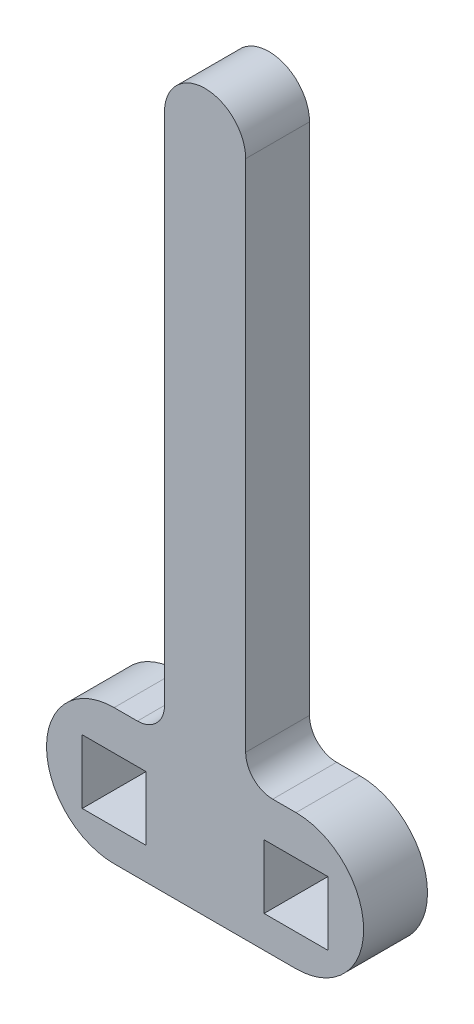
ISO-10303-21;
HEADER;
FILE_DESCRIPTION(('STEP AP214'),'2;1');
FILE_NAME('part.step','',(''),(''),'','','');
FILE_SCHEMA(('AUTOMOTIVE_DESIGN { 1 0 10303 214 1 1 1 1 }'));
ENDSEC;
DATA;
#1=APPLICATION_CONTEXT('core data for automotive mechanical design processes');
#2=APPLICATION_PROTOCOL_DEFINITION('international standard','automotive_design',2000,#1);
#3=PRODUCT_CONTEXT('',#1,'mechanical');
#4=PRODUCT('Part','Part','',(#3));
#5=PRODUCT_RELATED_PRODUCT_CATEGORY('part','',(#4));
#6=PRODUCT_DEFINITION_FORMATION('','',#4);
#7=PRODUCT_DEFINITION_CONTEXT('part definition',#1,'design');
#8=PRODUCT_DEFINITION('design','',#6,#7);
#9=PRODUCT_DEFINITION_SHAPE('','',#8);
#10=(LENGTH_UNIT() NAMED_UNIT(*) SI_UNIT(.MILLI.,.METRE.));
#11=(NAMED_UNIT(*) PLANE_ANGLE_UNIT() SI_UNIT($,.RADIAN.));
#12=(NAMED_UNIT(*) SI_UNIT($,.STERADIAN.) SOLID_ANGLE_UNIT());
#13=UNCERTAINTY_MEASURE_WITH_UNIT(LENGTH_MEASURE(1.E-05),#10,'distance_accuracy_value','');
#14=(GEOMETRIC_REPRESENTATION_CONTEXT(3) GLOBAL_UNCERTAINTY_ASSIGNED_CONTEXT((#13)) GLOBAL_UNIT_ASSIGNED_CONTEXT((#10,
#11,#12)) REPRESENTATION_CONTEXT('',''));
#15=CARTESIAN_POINT('',(0.,0.,0.));
#16=DIRECTION('',(0.,0.,1.));
#17=DIRECTION('',(1.,0.,0.));
#18=AXIS2_PLACEMENT_3D('',#15,#16,#17);
#19=CARTESIAN_POINT('',(384.610540850945,118.343994152131,5.9944));
#20=DIRECTION('',(0.,0.,1.));
#21=DIRECTION('',(1.,0.,0.));
#22=AXIS2_PLACEMENT_3D('',#19,#20,#21);
#23=PLANE('',#22);
#24=CARTESIAN_POINT('',(384.610540850945,118.343994152131,5.9944));
#25=DIRECTION('',(0.,0.,1.));
#26=DIRECTION('',(1.,0.,0.));
#27=AXIS2_PLACEMENT_3D('',#24,#25,#26);
#28=CIRCLE('',#27,6.34999999999999);
#29=CARTESIAN_POINT('',(384.610540850945,111.993994152131,5.9944));
#30=VERTEX_POINT('',#29);
#31=CARTESIAN_POINT('',(384.610540850945,124.693994152131,5.9944));
#32=VERTEX_POINT('',#31);
#33=EDGE_CURVE('E249',#30,#32,#28,.T.);
#34=ORIENTED_EDGE('',*,*,#33,.T.);
#35=DIRECTION('',(-1.,0.,0.));
#36=VECTOR('',#35,1.);
#37=CARTESIAN_POINT('',(384.610540850945,124.693994152131,5.9944));
#38=LINE('',#37,#36);
#39=CARTESIAN_POINT('',(382.424153120892,124.693994152131,5.9944));
#40=VERTEX_POINT('',#39);
#41=EDGE_CURVE('E254',#32,#40,#38,.T.);
#42=ORIENTED_EDGE('',*,*,#41,.T.);
#43=CARTESIAN_POINT('',(382.424153120892,127.233994152131,5.9944));
#44=DIRECTION('',(0.,0.,-1.));
#45=DIRECTION('',(1.,0.,0.));
#46=AXIS2_PLACEMENT_3D('',#43,#44,#45);
#47=CIRCLE('',#46,2.53999999999999);
#48=CARTESIAN_POINT('',(379.884153120892,127.233994152131,5.9944));
#49=VERTEX_POINT('',#48);
#50=EDGE_CURVE('E264',#40,#49,#47,.T.);
#51=ORIENTED_EDGE('',*,*,#50,.T.);
#52=DIRECTION('',(0.,1.,0.));
#53=VECTOR('',#52,1.);
#54=CARTESIAN_POINT('',(379.884153120892,127.233994152131,5.9944));
#55=LINE('',#54,#53);
#56=CARTESIAN_POINT('',(379.884153120892,175.493994152131,5.9944));
#57=VERTEX_POINT('',#56);
#58=EDGE_CURVE('E267',#49,#57,#55,.T.);
#59=ORIENTED_EDGE('',*,*,#58,.T.);
#60=CARTESIAN_POINT('',(376.074153120892,175.493994152131,5.9944));
#61=DIRECTION('',(0.,0.,1.));
#62=DIRECTION('',(1.,0.,0.));
#63=AXIS2_PLACEMENT_3D('',#60,#61,#62);
#64=CIRCLE('',#63,3.80999999999998);
#65=CARTESIAN_POINT('',(372.264153120892,175.493994152131,5.9944));
#66=VERTEX_POINT('',#65);
#67=EDGE_CURVE('E271',#57,#66,#64,.T.);
#68=ORIENTED_EDGE('',*,*,#67,.T.);
#69=DIRECTION('',(0.,-1.,0.));
#70=VECTOR('',#69,1.);
#71=CARTESIAN_POINT('',(372.264153120892,127.233994152131,5.9944));
#72=LINE('',#71,#70);
#73=CARTESIAN_POINT('',(372.264153120892,127.233994152131,5.9944));
#74=VERTEX_POINT('',#73);
#75=EDGE_CURVE('E275',#66,#74,#72,.T.);
#76=ORIENTED_EDGE('',*,*,#75,.T.);
#77=CARTESIAN_POINT('',(369.724153120892,127.233994152131,5.9944));
#78=DIRECTION('',(0.,0.,-1.));
#79=DIRECTION('',(-1.,0.,0.));
#80=AXIS2_PLACEMENT_3D('',#77,#78,#79);
#81=CIRCLE('',#80,2.53999999999999);
#82=CARTESIAN_POINT('',(369.724153120892,124.693994152131,5.9944));
#83=VERTEX_POINT('',#82);
#84=EDGE_CURVE('E283',#74,#83,#81,.T.);
#85=ORIENTED_EDGE('',*,*,#84,.T.);
#86=DIRECTION('',(-1.,0.,0.));
#87=VECTOR('',#86,1.);
#88=CARTESIAN_POINT('',(369.724153120892,124.693994152131,5.9944));
#89=LINE('',#88,#87);
#90=CARTESIAN_POINT('',(367.53776539084,124.693994152131,5.9944));
#91=VERTEX_POINT('',#90);
#92=EDGE_CURVE('E286',#83,#91,#89,.T.);
#93=ORIENTED_EDGE('',*,*,#92,.T.);
#94=CARTESIAN_POINT('',(367.53776539084,118.343994152131,5.9944));
#95=DIRECTION('',(0.,0.,1.));
#96=DIRECTION('',(1.,0.,0.));
#97=AXIS2_PLACEMENT_3D('',#94,#95,#96);
#98=CIRCLE('',#97,6.35000000000011);
#99=CARTESIAN_POINT('',(367.53776539084,111.993994152131,5.9944));
#100=VERTEX_POINT('',#99);
#101=EDGE_CURVE('E290',#91,#100,#98,.T.);
#102=ORIENTED_EDGE('',*,*,#101,.T.);
#103=DIRECTION('',(1.,0.,0.));
#104=VECTOR('',#103,1.);
#105=CARTESIAN_POINT('',(384.610540850945,111.993994152131,5.9944));
#106=LINE('',#105,#104);
#107=EDGE_CURVE('E294',#100,#30,#106,.T.);
#108=ORIENTED_EDGE('',*,*,#107,.T.);
#109=EDGE_LOOP('',(#34,#42,#51,#59,#68,#76,#85,#93,#102,#108));
#110=FACE_BOUND('',#109,.T.);
#111=DIRECTION('',(-1.,0.,0.));
#112=VECTOR('',#111,1.);
#113=CARTESIAN_POINT('',(387.607740850945,120.988448440542,5.9944));
#114=LINE('',#113,#112);
#115=CARTESIAN_POINT('',(387.607740850945,120.988448440542,5.9944));
#116=VERTEX_POINT('',#115);
#117=CARTESIAN_POINT('',(381.613340850945,120.988448440542,5.9944));
#118=VERTEX_POINT('',#117);
#119=EDGE_CURVE('E215',#116,#118,#114,.T.);
#120=ORIENTED_EDGE('',*,*,#119,.F.);
#121=DIRECTION('',(0.,1.,0.));
#122=VECTOR('',#121,1.);
#123=CARTESIAN_POINT('',(387.607740850945,114.994048440542,5.9944));
#124=LINE('',#123,#122);
#125=CARTESIAN_POINT('',(387.607740850945,114.994048440542,5.9944));
#126=VERTEX_POINT('',#125);
#127=EDGE_CURVE('E211',#126,#116,#124,.T.);
#128=ORIENTED_EDGE('',*,*,#127,.F.);
#129=DIRECTION('',(1.,0.,0.));
#130=VECTOR('',#129,1.);
#131=CARTESIAN_POINT('',(387.607740850945,114.994048440542,5.9944));
#132=LINE('',#131,#130);
#133=CARTESIAN_POINT('',(381.613340850945,114.994048440542,5.9944));
#134=VERTEX_POINT('',#133);
#135=EDGE_CURVE('E222',#134,#126,#132,.T.);
#136=ORIENTED_EDGE('',*,*,#135,.F.);
#137=DIRECTION('',(0.,-1.,0.));
#138=VECTOR('',#137,1.);
#139=CARTESIAN_POINT('',(381.613340850945,114.994048440542,5.9944));
#140=LINE('',#139,#138);
#141=EDGE_CURVE('E227',#118,#134,#140,.T.);
#142=ORIENTED_EDGE('',*,*,#141,.F.);
#143=EDGE_LOOP('',(#120,#128,#136,#142));
#144=FACE_BOUND('',#143,.T.);
#145=DIRECTION('',(1.,0.,0.));
#146=VECTOR('',#145,1.);
#147=CARTESIAN_POINT('',(364.540565390845,114.994048440543,5.9944));
#148=LINE('',#147,#146);
#149=CARTESIAN_POINT('',(364.540565390845,114.994048440543,5.9944));
#150=VERTEX_POINT('',#149);
#151=CARTESIAN_POINT('',(370.534965390845,114.994048440543,5.9944));
#152=VERTEX_POINT('',#151);
#153=EDGE_CURVE('E171',#150,#152,#148,.T.);
#154=ORIENTED_EDGE('',*,*,#153,.F.);
#155=DIRECTION('',(0.,-1.,0.));
#156=VECTOR('',#155,1.);
#157=CARTESIAN_POINT('',(364.540565390845,120.988448440543,5.9944));
#158=LINE('',#157,#156);
#159=CARTESIAN_POINT('',(364.540565390845,120.988448440543,5.9944));
#160=VERTEX_POINT('',#159);
#161=EDGE_CURVE('E162',#160,#150,#158,.T.);
#162=ORIENTED_EDGE('',*,*,#161,.F.);
#163=DIRECTION('',(-1.,0.,0.));
#164=VECTOR('',#163,1.);
#165=CARTESIAN_POINT('',(364.540565390845,120.988448440543,5.9944));
#166=LINE('',#165,#164);
#167=CARTESIAN_POINT('',(370.534965390845,120.988448440543,5.9944));
#168=VERTEX_POINT('',#167);
#169=EDGE_CURVE('E188',#168,#160,#166,.T.);
#170=ORIENTED_EDGE('',*,*,#169,.F.);
#171=DIRECTION('',(0.,1.,0.));
#172=VECTOR('',#171,1.);
#173=CARTESIAN_POINT('',(370.534965390845,120.988448440543,5.9944));
#174=LINE('',#173,#172);
#175=EDGE_CURVE('E183',#152,#168,#174,.T.);
#176=ORIENTED_EDGE('',*,*,#175,.F.);
#177=EDGE_LOOP('',(#154,#162,#170,#176));
#178=FACE_BOUND('',#177,.T.);
#179=ADVANCED_FACE('F37',(#110,#144,#178),#23,.T.);
#180=CARTESIAN_POINT('',(384.610540850945,118.343994152131,0.));
#181=DIRECTION('',(0.,0.,1.));
#182=DIRECTION('',(1.,0.,0.));
#183=AXIS2_PLACEMENT_3D('',#180,#181,#182);
#184=PLANE('',#183);
#185=DIRECTION('',(0.,1.,0.));
#186=VECTOR('',#185,1.);
#187=CARTESIAN_POINT('',(387.607740850945,114.994048440542,0.));
#188=LINE('',#187,#186);
#189=CARTESIAN_POINT('',(387.607740850945,114.994048440542,0.));
#190=VERTEX_POINT('',#189);
#191=CARTESIAN_POINT('',(387.607740850945,120.988448440542,0.));
#192=VERTEX_POINT('',#191);
#193=EDGE_CURVE('E179',#190,#192,#188,.T.);
#194=ORIENTED_EDGE('',*,*,#193,.T.);
#195=DIRECTION('',(-1.,0.,0.));
#196=VECTOR('',#195,1.);
#197=CARTESIAN_POINT('',(387.607740850945,120.988448440542,0.));
#198=LINE('',#197,#196);
#199=CARTESIAN_POINT('',(381.613340850945,120.988448440542,0.));
#200=VERTEX_POINT('',#199);
#201=EDGE_CURVE('E231',#192,#200,#198,.T.);
#202=ORIENTED_EDGE('',*,*,#201,.T.);
#203=DIRECTION('',(0.,-1.,0.));
#204=VECTOR('',#203,1.);
#205=CARTESIAN_POINT('',(381.613340850945,114.994048440542,0.));
#206=LINE('',#205,#204);
#207=CARTESIAN_POINT('',(381.613340850945,114.994048440542,0.));
#208=VERTEX_POINT('',#207);
#209=EDGE_CURVE('E234',#200,#208,#206,.T.);
#210=ORIENTED_EDGE('',*,*,#209,.T.);
#211=DIRECTION('',(1.,0.,0.));
#212=VECTOR('',#211,1.);
#213=CARTESIAN_POINT('',(387.607740850945,114.994048440542,0.));
#214=LINE('',#213,#212);
#215=EDGE_CURVE('E216',#208,#190,#214,.T.);
#216=ORIENTED_EDGE('',*,*,#215,.T.);
#217=EDGE_LOOP('',(#194,#202,#210,#216));
#218=FACE_BOUND('',#217,.T.);
#219=CARTESIAN_POINT('',(384.610540850945,118.343994152131,0.));
#220=DIRECTION('',(0.,0.,1.));
#221=DIRECTION('',(1.,0.,0.));
#222=AXIS2_PLACEMENT_3D('',#219,#220,#221);
#223=CIRCLE('',#222,6.34999999999999);
#224=CARTESIAN_POINT('',(384.610540850945,111.993994152131,0.));
#225=VERTEX_POINT('',#224);
#226=CARTESIAN_POINT('',(384.610540850945,124.693994152131,0.));
#227=VERTEX_POINT('',#226);
#228=EDGE_CURVE('E248',#225,#227,#223,.T.);
#229=ORIENTED_EDGE('',*,*,#228,.F.);
#230=DIRECTION('',(1.,0.,0.));
#231=VECTOR('',#230,1.);
#232=CARTESIAN_POINT('',(384.610540850945,111.993994152131,0.));
#233=LINE('',#232,#231);
#234=CARTESIAN_POINT('',(367.53776539084,111.993994152131,0.));
#235=VERTEX_POINT('',#234);
#236=EDGE_CURVE('E255',#235,#225,#233,.T.);
#237=ORIENTED_EDGE('',*,*,#236,.F.);
#238=CARTESIAN_POINT('',(367.53776539084,118.343994152131,0.));
#239=DIRECTION('',(0.,0.,1.));
#240=DIRECTION('',(1.,0.,0.));
#241=AXIS2_PLACEMENT_3D('',#238,#239,#240);
#242=CIRCLE('',#241,6.35000000000011);
#243=CARTESIAN_POINT('',(367.53776539084,124.693994152131,0.));
#244=VERTEX_POINT('',#243);
#245=EDGE_CURVE('E315',#244,#235,#242,.T.);
#246=ORIENTED_EDGE('',*,*,#245,.F.);
#247=DIRECTION('',(-1.,0.,0.));
#248=VECTOR('',#247,1.);
#249=CARTESIAN_POINT('',(369.724153120892,124.693994152131,0.));
#250=LINE('',#249,#248);
#251=CARTESIAN_POINT('',(369.724153120892,124.693994152131,0.));
#252=VERTEX_POINT('',#251);
#253=EDGE_CURVE('E313',#252,#244,#250,.T.);
#254=ORIENTED_EDGE('',*,*,#253,.F.);
#255=CARTESIAN_POINT('',(369.724153120892,127.233994152131,0.));
#256=DIRECTION('',(0.,0.,-1.));
#257=DIRECTION('',(-1.,0.,0.));
#258=AXIS2_PLACEMENT_3D('',#255,#256,#257);
#259=CIRCLE('',#258,2.53999999999999);
#260=CARTESIAN_POINT('',(372.264153120892,127.233994152131,0.));
#261=VERTEX_POINT('',#260);
#262=EDGE_CURVE('E311',#261,#252,#259,.T.);
#263=ORIENTED_EDGE('',*,*,#262,.F.);
#264=DIRECTION('',(0.,-1.,0.));
#265=VECTOR('',#264,1.);
#266=CARTESIAN_POINT('',(372.264153120892,127.233994152131,0.));
#267=LINE('',#266,#265);
#268=CARTESIAN_POINT('',(372.264153120892,175.493994152131,0.));
#269=VERTEX_POINT('',#268);
#270=EDGE_CURVE('E309',#269,#261,#267,.T.);
#271=ORIENTED_EDGE('',*,*,#270,.F.);
#272=CARTESIAN_POINT('',(376.074153120892,175.493994152131,0.));
#273=DIRECTION('',(0.,0.,1.));
#274=DIRECTION('',(1.,0.,0.));
#275=AXIS2_PLACEMENT_3D('',#272,#273,#274);
#276=CIRCLE('',#275,3.80999999999998);
#277=CARTESIAN_POINT('',(379.884153120892,175.493994152131,0.));
#278=VERTEX_POINT('',#277);
#279=EDGE_CURVE('E307',#278,#269,#276,.T.);
#280=ORIENTED_EDGE('',*,*,#279,.F.);
#281=DIRECTION('',(0.,1.,0.));
#282=VECTOR('',#281,1.);
#283=CARTESIAN_POINT('',(379.884153120892,127.233994152131,0.));
#284=LINE('',#283,#282);
#285=CARTESIAN_POINT('',(379.884153120892,127.233994152131,0.));
#286=VERTEX_POINT('',#285);
#287=EDGE_CURVE('E305',#286,#278,#284,.T.);
#288=ORIENTED_EDGE('',*,*,#287,.F.);
#289=CARTESIAN_POINT('',(382.424153120892,127.233994152131,0.));
#290=DIRECTION('',(0.,0.,-1.));
#291=DIRECTION('',(1.,0.,0.));
#292=AXIS2_PLACEMENT_3D('',#289,#290,#291);
#293=CIRCLE('',#292,2.53999999999999);
#294=CARTESIAN_POINT('',(382.424153120892,124.693994152131,0.));
#295=VERTEX_POINT('',#294);
#296=EDGE_CURVE('E303',#295,#286,#293,.T.);
#297=ORIENTED_EDGE('',*,*,#296,.F.);
#298=DIRECTION('',(-1.,0.,0.));
#299=VECTOR('',#298,1.);
#300=CARTESIAN_POINT('',(384.610540850945,124.693994152131,0.));
#301=LINE('',#300,#299);
#302=EDGE_CURVE('E301',#227,#295,#301,.T.);
#303=ORIENTED_EDGE('',*,*,#302,.F.);
#304=EDGE_LOOP('',(#229,#237,#246,#254,#263,#271,#280,#288,#297,#303));
#305=FACE_BOUND('',#304,.T.);
#306=DIRECTION('',(0.,-1.,0.));
#307=VECTOR('',#306,1.);
#308=CARTESIAN_POINT('',(364.540565390845,120.988448440543,0.));
#309=LINE('',#308,#307);
#310=CARTESIAN_POINT('',(364.540565390845,120.988448440543,0.));
#311=VERTEX_POINT('',#310);
#312=CARTESIAN_POINT('',(364.540565390845,114.994048440543,0.));
#313=VERTEX_POINT('',#312);
#314=EDGE_CURVE('E60',#311,#313,#309,.T.);
#315=ORIENTED_EDGE('',*,*,#314,.T.);
#316=DIRECTION('',(1.,0.,0.));
#317=VECTOR('',#316,1.);
#318=CARTESIAN_POINT('',(364.540565390845,114.994048440543,0.));
#319=LINE('',#318,#317);
#320=CARTESIAN_POINT('',(370.534965390845,114.994048440543,0.));
#321=VERTEX_POINT('',#320);
#322=EDGE_CURVE('E178',#313,#321,#319,.T.);
#323=ORIENTED_EDGE('',*,*,#322,.T.);
#324=DIRECTION('',(0.,1.,0.));
#325=VECTOR('',#324,1.);
#326=CARTESIAN_POINT('',(370.534965390845,120.988448440543,0.));
#327=LINE('',#326,#325);
#328=CARTESIAN_POINT('',(370.534965390845,120.988448440543,0.));
#329=VERTEX_POINT('',#328);
#330=EDGE_CURVE('E203',#321,#329,#327,.T.);
#331=ORIENTED_EDGE('',*,*,#330,.T.);
#332=DIRECTION('',(-1.,0.,0.));
#333=VECTOR('',#332,1.);
#334=CARTESIAN_POINT('',(364.540565390845,120.988448440543,0.));
#335=LINE('',#334,#333);
#336=EDGE_CURVE('E172',#329,#311,#335,.T.);
#337=ORIENTED_EDGE('',*,*,#336,.T.);
#338=EDGE_LOOP('',(#315,#323,#331,#337));
#339=FACE_BOUND('',#338,.T.);
#340=ADVANCED_FACE('F351',(#218,#305,#339),#184,.F.);
#341=CARTESIAN_POINT('',(384.610540850945,118.343994152131,5.9944));
#342=DIRECTION('',(0.,0.,-1.));
#343=DIRECTION('',(-1.,0.,0.));
#344=AXIS2_PLACEMENT_3D('',#341,#342,#343);
#345=CYLINDRICAL_SURFACE('',#344,6.34999999999999);
#346=ORIENTED_EDGE('',*,*,#228,.T.);
#347=DIRECTION('',(0.,0.,-1.));
#348=VECTOR('',#347,1.);
#349=CARTESIAN_POINT('',(384.610540850945,124.693994152131,5.9944));
#350=LINE('',#349,#348);
#351=EDGE_CURVE('E12',#32,#227,#350,.T.);
#352=ORIENTED_EDGE('',*,*,#351,.F.);
#353=ORIENTED_EDGE('',*,*,#33,.F.);
#354=DIRECTION('',(0.,0.,-1.));
#355=VECTOR('',#354,1.);
#356=CARTESIAN_POINT('',(384.610540850945,111.993994152131,5.9944));
#357=LINE('',#356,#355);
#358=EDGE_CURVE('E298',#30,#225,#357,.T.);
#359=ORIENTED_EDGE('',*,*,#358,.T.);
#360=EDGE_LOOP('',(#346,#352,#353,#359));
#361=FACE_BOUND('',#360,.T.);
#362=ADVANCED_FACE('F39',(#361),#345,.T.);
#363=CARTESIAN_POINT('',(384.610540850945,124.693994152131,5.9944));
#364=DIRECTION('',(0.,-1.,0.));
#365=DIRECTION('',(0.,0.,-1.));
#366=AXIS2_PLACEMENT_3D('',#363,#364,#365);
#367=PLANE('',#366);
#368=ORIENTED_EDGE('',*,*,#302,.T.);
#369=DIRECTION('',(0.,0.,-1.));
#370=VECTOR('',#369,1.);
#371=CARTESIAN_POINT('',(382.424153120892,124.693994152131,5.9944));
#372=LINE('',#371,#370);
#373=EDGE_CURVE('E45',#40,#295,#372,.T.);
#374=ORIENTED_EDGE('',*,*,#373,.F.);
#375=ORIENTED_EDGE('',*,*,#41,.F.);
#376=ORIENTED_EDGE('',*,*,#351,.T.);
#377=EDGE_LOOP('',(#368,#374,#375,#376));
#378=FACE_BOUND('',#377,.T.);
#379=ADVANCED_FACE('F431',(#378),#367,.F.);
#380=CARTESIAN_POINT('',(382.424153120892,127.233994152131,5.9944));
#381=DIRECTION('',(0.,0.,-1.));
#382=DIRECTION('',(-1.,0.,0.));
#383=AXIS2_PLACEMENT_3D('',#380,#381,#382);
#384=CYLINDRICAL_SURFACE('',#383,2.53999999999999);
#385=ORIENTED_EDGE('',*,*,#296,.T.);
#386=DIRECTION('',(0.,0.,-1.));
#387=VECTOR('',#386,1.);
#388=CARTESIAN_POINT('',(379.884153120892,127.233994152131,5.9944));
#389=LINE('',#388,#387);
#390=EDGE_CURVE('E338',#49,#286,#389,.T.);
#391=ORIENTED_EDGE('',*,*,#390,.F.);
#392=ORIENTED_EDGE('',*,*,#50,.F.);
#393=ORIENTED_EDGE('',*,*,#373,.T.);
#394=EDGE_LOOP('',(#385,#391,#392,#393));
#395=FACE_BOUND('',#394,.T.);
#396=ADVANCED_FACE('F345',(#395),#384,.F.);
#397=CARTESIAN_POINT('',(379.884153120892,127.233994152131,5.9944));
#398=DIRECTION('',(-1.,0.,0.));
#399=DIRECTION('',(0.,0.,1.));
#400=AXIS2_PLACEMENT_3D('',#397,#398,#399);
#401=PLANE('',#400);
#402=ORIENTED_EDGE('',*,*,#287,.T.);
#403=DIRECTION('',(0.,0.,-1.));
#404=VECTOR('',#403,1.);
#405=CARTESIAN_POINT('',(379.884153120892,175.493994152131,5.9944));
#406=LINE('',#405,#404);
#407=EDGE_CURVE('E335',#57,#278,#406,.T.);
#408=ORIENTED_EDGE('',*,*,#407,.F.);
#409=ORIENTED_EDGE('',*,*,#58,.F.);
#410=ORIENTED_EDGE('',*,*,#390,.T.);
#411=EDGE_LOOP('',(#402,#408,#409,#410));
#412=FACE_BOUND('',#411,.T.);
#413=ADVANCED_FACE('F357',(#412),#401,.F.);
#414=CARTESIAN_POINT('',(376.074153120892,175.493994152131,5.9944));
#415=DIRECTION('',(0.,0.,-1.));
#416=DIRECTION('',(-1.,0.,0.));
#417=AXIS2_PLACEMENT_3D('',#414,#415,#416);
#418=CYLINDRICAL_SURFACE('',#417,3.80999999999998);
#419=ORIENTED_EDGE('',*,*,#279,.T.);
#420=DIRECTION('',(0.,0.,-1.));
#421=VECTOR('',#420,1.);
#422=CARTESIAN_POINT('',(372.264153120892,175.493994152131,5.9944));
#423=LINE('',#422,#421);
#424=EDGE_CURVE('E332',#66,#269,#423,.T.);
#425=ORIENTED_EDGE('',*,*,#424,.F.);
#426=ORIENTED_EDGE('',*,*,#67,.F.);
#427=ORIENTED_EDGE('',*,*,#407,.T.);
#428=EDGE_LOOP('',(#419,#425,#426,#427));
#429=FACE_BOUND('',#428,.T.);
#430=ADVANCED_FACE('F361',(#429),#418,.T.);
#431=CARTESIAN_POINT('',(372.264153120892,127.233994152131,5.9944));
#432=DIRECTION('',(1.,0.,0.));
#433=DIRECTION('',(0.,0.,-1.));
#434=AXIS2_PLACEMENT_3D('',#431,#432,#433);
#435=PLANE('',#434);
#436=ORIENTED_EDGE('',*,*,#270,.T.);
#437=DIRECTION('',(0.,0.,-1.));
#438=VECTOR('',#437,1.);
#439=CARTESIAN_POINT('',(372.264153120892,127.233994152131,5.9944));
#440=LINE('',#439,#438);
#441=EDGE_CURVE('E329',#74,#261,#440,.T.);
#442=ORIENTED_EDGE('',*,*,#441,.F.);
#443=ORIENTED_EDGE('',*,*,#75,.F.);
#444=ORIENTED_EDGE('',*,*,#424,.T.);
#445=EDGE_LOOP('',(#436,#442,#443,#444));
#446=FACE_BOUND('',#445,.T.);
#447=ADVANCED_FACE('F421',(#446),#435,.F.);
#448=CARTESIAN_POINT('',(369.724153120892,127.233994152131,5.9944));
#449=DIRECTION('',(0.,0.,-1.));
#450=DIRECTION('',(-1.,0.,0.));
#451=AXIS2_PLACEMENT_3D('',#448,#449,#450);
#452=CYLINDRICAL_SURFACE('',#451,2.53999999999999);
#453=ORIENTED_EDGE('',*,*,#262,.T.);
#454=DIRECTION('',(0.,0.,-1.));
#455=VECTOR('',#454,1.);
#456=CARTESIAN_POINT('',(369.724153120892,124.693994152131,5.9944));
#457=LINE('',#456,#455);
#458=EDGE_CURVE('E326',#83,#252,#457,.T.);
#459=ORIENTED_EDGE('',*,*,#458,.F.);
#460=ORIENTED_EDGE('',*,*,#84,.F.);
#461=ORIENTED_EDGE('',*,*,#441,.T.);
#462=EDGE_LOOP('',(#453,#459,#460,#461));
#463=FACE_BOUND('',#462,.T.);
#464=ADVANCED_FACE('F417',(#463),#452,.F.);
#465=CARTESIAN_POINT('',(369.724153120892,124.693994152131,5.9944));
#466=DIRECTION('',(0.,-1.,0.));
#467=DIRECTION('',(0.,0.,-1.));
#468=AXIS2_PLACEMENT_3D('',#465,#466,#467);
#469=PLANE('',#468);
#470=ORIENTED_EDGE('',*,*,#253,.T.);
#471=DIRECTION('',(0.,0.,-1.));
#472=VECTOR('',#471,1.);
#473=CARTESIAN_POINT('',(367.53776539084,124.693994152131,5.9944));
#474=LINE('',#473,#472);
#475=EDGE_CURVE('E323',#91,#244,#474,.T.);
#476=ORIENTED_EDGE('',*,*,#475,.F.);
#477=ORIENTED_EDGE('',*,*,#92,.F.);
#478=ORIENTED_EDGE('',*,*,#458,.T.);
#479=EDGE_LOOP('',(#470,#476,#477,#478));
#480=FACE_BOUND('',#479,.T.);
#481=ADVANCED_FACE('F413',(#480),#469,.F.);
#482=CARTESIAN_POINT('',(367.53776539084,118.343994152131,5.9944));
#483=DIRECTION('',(0.,0.,-1.));
#484=DIRECTION('',(-1.,0.,0.));
#485=AXIS2_PLACEMENT_3D('',#482,#483,#484);
#486=CYLINDRICAL_SURFACE('',#485,6.35000000000011);
#487=ORIENTED_EDGE('',*,*,#245,.T.);
#488=DIRECTION('',(0.,0.,-1.));
#489=VECTOR('',#488,1.);
#490=CARTESIAN_POINT('',(367.53776539084,111.993994152131,5.9944));
#491=LINE('',#490,#489);
#492=EDGE_CURVE('E320',#100,#235,#491,.T.);
#493=ORIENTED_EDGE('',*,*,#492,.F.);
#494=ORIENTED_EDGE('',*,*,#101,.F.);
#495=ORIENTED_EDGE('',*,*,#475,.T.);
#496=EDGE_LOOP('',(#487,#493,#494,#495));
#497=FACE_BOUND('',#496,.T.);
#498=ADVANCED_FACE('F409',(#497),#486,.T.);
#499=CARTESIAN_POINT('',(384.610540850945,111.993994152131,5.9944));
#500=DIRECTION('',(0.,1.,0.));
#501=DIRECTION('',(-1.,0.,0.));
#502=AXIS2_PLACEMENT_3D('',#499,#500,#501);
#503=PLANE('',#502);
#504=ORIENTED_EDGE('',*,*,#236,.T.);
#505=ORIENTED_EDGE('',*,*,#358,.F.);
#506=ORIENTED_EDGE('',*,*,#107,.F.);
#507=ORIENTED_EDGE('',*,*,#492,.T.);
#508=EDGE_LOOP('',(#504,#505,#506,#507));
#509=FACE_BOUND('',#508,.T.);
#510=ADVANCED_FACE('F398',(#509),#503,.F.);
#511=CARTESIAN_POINT('',(387.607740850945,114.994048440542,5.9944));
#512=DIRECTION('',(-1.,0.,0.));
#513=DIRECTION('',(0.,0.,1.));
#514=AXIS2_PLACEMENT_3D('',#511,#512,#513);
#515=PLANE('',#514);
#516=ORIENTED_EDGE('',*,*,#193,.F.);
#517=DIRECTION('',(0.,0.,-1.));
#518=VECTOR('',#517,1.);
#519=CARTESIAN_POINT('',(387.607740850945,114.994048440542,5.9944));
#520=LINE('',#519,#518);
#521=EDGE_CURVE('E226',#126,#190,#520,.T.);
#522=ORIENTED_EDGE('',*,*,#521,.F.);
#523=ORIENTED_EDGE('',*,*,#127,.T.);
#524=DIRECTION('',(0.,0.,-1.));
#525=VECTOR('',#524,1.);
#526=CARTESIAN_POINT('',(387.607740850945,120.988448440542,5.9944));
#527=LINE('',#526,#525);
#528=EDGE_CURVE('E245',#116,#192,#527,.T.);
#529=ORIENTED_EDGE('',*,*,#528,.T.);
#530=EDGE_LOOP('',(#516,#522,#523,#529));
#531=FACE_BOUND('',#530,.T.);
#532=ADVANCED_FACE('F386',(#531),#515,.T.);
#533=CARTESIAN_POINT('',(387.607740850945,120.988448440542,5.9944));
#534=DIRECTION('',(0.,-1.,0.));
#535=DIRECTION('',(0.,0.,-1.));
#536=AXIS2_PLACEMENT_3D('',#533,#534,#535);
#537=PLANE('',#536);
#538=ORIENTED_EDGE('',*,*,#201,.F.);
#539=ORIENTED_EDGE('',*,*,#528,.F.);
#540=ORIENTED_EDGE('',*,*,#119,.T.);
#541=DIRECTION('',(0.,0.,-1.));
#542=VECTOR('',#541,1.);
#543=CARTESIAN_POINT('',(381.613340850945,120.988448440542,5.9944));
#544=LINE('',#543,#542);
#545=EDGE_CURVE('E243',#118,#200,#544,.T.);
#546=ORIENTED_EDGE('',*,*,#545,.T.);
#547=EDGE_LOOP('',(#538,#539,#540,#546));
#548=FACE_BOUND('',#547,.T.);
#549=ADVANCED_FACE('F390',(#548),#537,.T.);
#550=CARTESIAN_POINT('',(381.613340850945,114.994048440542,5.9944));
#551=DIRECTION('',(1.,0.,0.));
#552=DIRECTION('',(0.,0.,-1.));
#553=AXIS2_PLACEMENT_3D('',#550,#551,#552);
#554=PLANE('',#553);
#555=ORIENTED_EDGE('',*,*,#209,.F.);
#556=ORIENTED_EDGE('',*,*,#545,.F.);
#557=ORIENTED_EDGE('',*,*,#141,.T.);
#558=DIRECTION('',(0.,0.,-1.));
#559=VECTOR('',#558,1.);
#560=CARTESIAN_POINT('',(381.613340850945,114.994048440542,5.9944));
#561=LINE('',#560,#559);
#562=EDGE_CURVE('E241',#134,#208,#561,.T.);
#563=ORIENTED_EDGE('',*,*,#562,.T.);
#564=EDGE_LOOP('',(#555,#556,#557,#563));
#565=FACE_BOUND('',#564,.T.);
#566=ADVANCED_FACE('F378',(#565),#554,.T.);
#567=CARTESIAN_POINT('',(387.607740850945,114.994048440542,5.9944));
#568=DIRECTION('',(0.,1.,0.));
#569=DIRECTION('',(0.,0.,1.));
#570=AXIS2_PLACEMENT_3D('',#567,#568,#569);
#571=PLANE('',#570);
#572=ORIENTED_EDGE('',*,*,#215,.F.);
#573=ORIENTED_EDGE('',*,*,#562,.F.);
#574=ORIENTED_EDGE('',*,*,#135,.T.);
#575=ORIENTED_EDGE('',*,*,#521,.T.);
#576=EDGE_LOOP('',(#572,#573,#574,#575));
#577=FACE_BOUND('',#576,.T.);
#578=ADVANCED_FACE('F384',(#577),#571,.T.);
#579=CARTESIAN_POINT('',(364.540565390845,120.988448440543,5.9944));
#580=DIRECTION('',(1.,0.,0.));
#581=DIRECTION('',(0.,0.,-1.));
#582=AXIS2_PLACEMENT_3D('',#579,#580,#581);
#583=PLANE('',#582);
#584=ORIENTED_EDGE('',*,*,#314,.F.);
#585=DIRECTION('',(0.,0.,-1.));
#586=VECTOR('',#585,1.);
#587=CARTESIAN_POINT('',(364.540565390845,120.988448440543,5.9944));
#588=LINE('',#587,#586);
#589=EDGE_CURVE('E166',#160,#311,#588,.T.);
#590=ORIENTED_EDGE('',*,*,#589,.F.);
#591=ORIENTED_EDGE('',*,*,#161,.T.);
#592=DIRECTION('',(0.,0.,-1.));
#593=VECTOR('',#592,1.);
#594=CARTESIAN_POINT('',(364.540565390845,114.994048440543,5.9944));
#595=LINE('',#594,#593);
#596=EDGE_CURVE('E165',#150,#313,#595,.T.);
#597=ORIENTED_EDGE('',*,*,#596,.T.);
#598=EDGE_LOOP('',(#584,#590,#591,#597));
#599=FACE_BOUND('',#598,.T.);
#600=ADVANCED_FACE('F164',(#599),#583,.T.);
#601=CARTESIAN_POINT('',(364.540565390845,114.994048440543,5.9944));
#602=DIRECTION('',(0.,1.,0.));
#603=DIRECTION('',(0.,0.,1.));
#604=AXIS2_PLACEMENT_3D('',#601,#602,#603);
#605=PLANE('',#604);
#606=ORIENTED_EDGE('',*,*,#322,.F.);
#607=ORIENTED_EDGE('',*,*,#596,.F.);
#608=ORIENTED_EDGE('',*,*,#153,.T.);
#609=DIRECTION('',(0.,0.,-1.));
#610=VECTOR('',#609,1.);
#611=CARTESIAN_POINT('',(370.534965390845,114.994048440543,5.9944));
#612=LINE('',#611,#610);
#613=EDGE_CURVE('E180',#152,#321,#612,.T.);
#614=ORIENTED_EDGE('',*,*,#613,.T.);
#615=EDGE_LOOP('',(#606,#607,#608,#614));
#616=FACE_BOUND('',#615,.T.);
#617=ADVANCED_FACE('F175',(#616),#605,.T.);
#618=CARTESIAN_POINT('',(370.534965390845,120.988448440543,5.9944));
#619=DIRECTION('',(-1.,0.,0.));
#620=DIRECTION('',(0.,0.,1.));
#621=AXIS2_PLACEMENT_3D('',#618,#619,#620);
#622=PLANE('',#621);
#623=ORIENTED_EDGE('',*,*,#330,.F.);
#624=ORIENTED_EDGE('',*,*,#613,.F.);
#625=ORIENTED_EDGE('',*,*,#175,.T.);
#626=DIRECTION('',(0.,0.,-1.));
#627=VECTOR('',#626,1.);
#628=CARTESIAN_POINT('',(370.534965390845,120.988448440543,5.9944));
#629=LINE('',#628,#627);
#630=EDGE_CURVE('E52',#168,#329,#629,.T.);
#631=ORIENTED_EDGE('',*,*,#630,.T.);
#632=EDGE_LOOP('',(#623,#624,#625,#631));
#633=FACE_BOUND('',#632,.T.);
#634=ADVANCED_FACE('F543',(#633),#622,.T.);
#635=CARTESIAN_POINT('',(364.540565390845,120.988448440543,5.9944));
#636=DIRECTION('',(0.,-1.,0.));
#637=DIRECTION('',(0.,0.,-1.));
#638=AXIS2_PLACEMENT_3D('',#635,#636,#637);
#639=PLANE('',#638);
#640=ORIENTED_EDGE('',*,*,#336,.F.);
#641=ORIENTED_EDGE('',*,*,#630,.F.);
#642=ORIENTED_EDGE('',*,*,#169,.T.);
#643=ORIENTED_EDGE('',*,*,#589,.T.);
#644=EDGE_LOOP('',(#640,#641,#642,#643));
#645=FACE_BOUND('',#644,.T.);
#646=ADVANCED_FACE('F551',(#645),#639,.T.);
#647=CLOSED_SHELL('',(#179,#340,#362,#379,#396,#413,#430,#447,#464,#481,#498,#510,#532,#549,
#566,#578,#600,#617,#634,#646));
#648=MANIFOLD_SOLID_BREP('B2',#647);
#649=ADVANCED_BREP_SHAPE_REPRESENTATION('',(#18,#648),#14);
#650=SHAPE_DEFINITION_REPRESENTATION(#9,#649);
ENDSEC;
END-ISO-10303-21;
